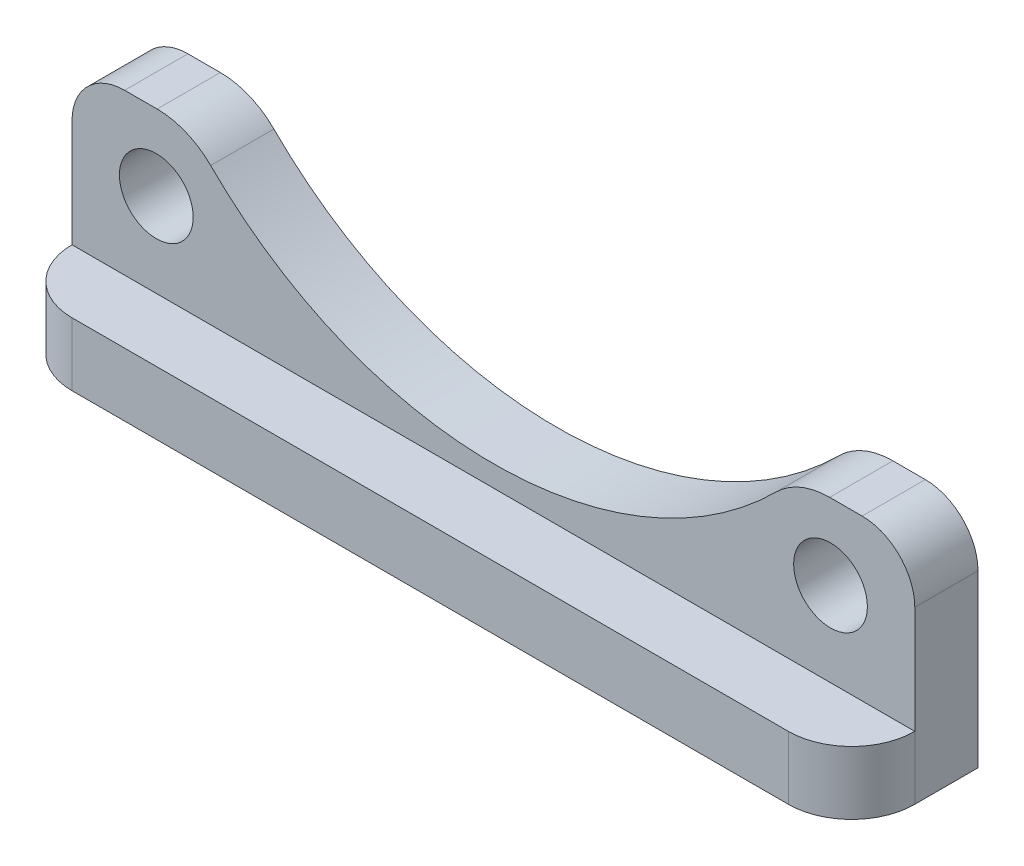
ISO-10303-21;
HEADER;
FILE_DESCRIPTION(('STEP AP214'),'2;1');
FILE_NAME('part.step','',(''),(''),'','','');
FILE_SCHEMA(('AUTOMOTIVE_DESIGN { 1 0 10303 214 1 1 1 1 }'));
ENDSEC;
DATA;
#1=APPLICATION_CONTEXT('core data for automotive mechanical design processes');
#2=APPLICATION_PROTOCOL_DEFINITION('international standard','automotive_design',2000,#1);
#3=PRODUCT_CONTEXT('',#1,'mechanical');
#4=PRODUCT('Part','Part','',(#3));
#5=PRODUCT_RELATED_PRODUCT_CATEGORY('part','',(#4));
#6=PRODUCT_DEFINITION_FORMATION('','',#4);
#7=PRODUCT_DEFINITION_CONTEXT('part definition',#1,'design');
#8=PRODUCT_DEFINITION('design','',#6,#7);
#9=PRODUCT_DEFINITION_SHAPE('','',#8);
#10=(LENGTH_UNIT() NAMED_UNIT(*) SI_UNIT(.MILLI.,.METRE.));
#11=(NAMED_UNIT(*) PLANE_ANGLE_UNIT() SI_UNIT($,.RADIAN.));
#12=(NAMED_UNIT(*) SI_UNIT($,.STERADIAN.) SOLID_ANGLE_UNIT());
#13=UNCERTAINTY_MEASURE_WITH_UNIT(LENGTH_MEASURE(1.E-05),#10,'distance_accuracy_value','');
#14=(GEOMETRIC_REPRESENTATION_CONTEXT(3) GLOBAL_UNCERTAINTY_ASSIGNED_CONTEXT((#13)) GLOBAL_UNIT_ASSIGNED_CONTEXT((#10,
#11,#12)) REPRESENTATION_CONTEXT('',''));
#15=CARTESIAN_POINT('',(0.,0.,0.));
#16=DIRECTION('',(0.,0.,1.));
#17=DIRECTION('',(1.,0.,0.));
#18=AXIS2_PLACEMENT_3D('',#15,#16,#17);
#19=CARTESIAN_POINT('',(-20.,5.30000000000001,3.));
#20=DIRECTION('',(0.,-1.,0.));
#21=DIRECTION('',(0.,0.,-1.));
#22=AXIS2_PLACEMENT_3D('',#19,#20,#21);
#23=PLANE('',#22);
#24=DIRECTION('',(-1.,0.,0.));
#25=VECTOR('',#24,1.);
#26=CARTESIAN_POINT('',(-20.,5.30000000000001,3.));
#27=LINE('',#26,#25);
#28=CARTESIAN_POINT('',(-15.961202962183,5.30000000000001,3.));
#29=VERTEX_POINT('',#28);
#30=CARTESIAN_POINT('',(-17.5,5.30000000000001,3.));
#31=VERTEX_POINT('',#30);
#32=EDGE_CURVE('E274',#29,#31,#27,.T.);
#33=ORIENTED_EDGE('',*,*,#32,.F.);
#34=DIRECTION('',(0.,0.,-1.));
#35=VECTOR('',#34,1.);
#36=CARTESIAN_POINT('',(-15.961202962183,5.30000000000001,3.));
#37=LINE('',#36,#35);
#38=CARTESIAN_POINT('',(-15.961202962183,5.30000000000001,0.));
#39=VERTEX_POINT('',#38);
#40=EDGE_CURVE('E12',#29,#39,#37,.T.);
#41=ORIENTED_EDGE('',*,*,#40,.T.);
#42=DIRECTION('',(-1.,0.,0.));
#43=VECTOR('',#42,1.);
#44=CARTESIAN_POINT('',(-20.,5.30000000000001,0.));
#45=LINE('',#44,#43);
#46=CARTESIAN_POINT('',(-17.5,5.30000000000001,0.));
#47=VERTEX_POINT('',#46);
#48=EDGE_CURVE('E242',#39,#47,#45,.T.);
#49=ORIENTED_EDGE('',*,*,#48,.T.);
#50=DIRECTION('',(0.,0.,-1.));
#51=VECTOR('',#50,1.);
#52=CARTESIAN_POINT('',(-17.5,5.30000000000001,3.));
#53=LINE('',#52,#51);
#54=EDGE_CURVE('E202',#47,#31,#53,.F.);
#55=ORIENTED_EDGE('',*,*,#54,.T.);
#56=EDGE_LOOP('',(#33,#41,#49,#55));
#57=FACE_BOUND('',#56,.T.);
#58=ADVANCED_FACE('F55',(#57),#23,.F.);
#59=CARTESIAN_POINT('',(20.,5.30000000000001,3.));
#60=DIRECTION('',(-1.,0.,0.));
#61=DIRECTION('',(0.,-1.,0.));
#62=AXIS2_PLACEMENT_3D('',#59,#60,#61);
#63=PLANE('',#62);
#64=DIRECTION('',(0.,1.,0.));
#65=VECTOR('',#64,1.);
#66=CARTESIAN_POINT('',(20.,5.30000000000001,0.));
#67=LINE('',#66,#65);
#68=CARTESIAN_POINT('',(20.,-5.3,0.));
#69=VERTEX_POINT('',#68);
#70=CARTESIAN_POINT('',(20.,2.80000000000001,0.));
#71=VERTEX_POINT('',#70);
#72=EDGE_CURVE('E246',#69,#71,#67,.T.);
#73=ORIENTED_EDGE('',*,*,#72,.T.);
#74=DIRECTION('',(0.,0.,-1.));
#75=VECTOR('',#74,1.);
#76=CARTESIAN_POINT('',(20.,2.80000000000001,3.));
#77=LINE('',#76,#75);
#78=CARTESIAN_POINT('',(20.,2.80000000000001,3.));
#79=VERTEX_POINT('',#78);
#80=EDGE_CURVE('E211',#71,#79,#77,.F.);
#81=ORIENTED_EDGE('',*,*,#80,.T.);
#82=DIRECTION('',(0.,1.,0.));
#83=VECTOR('',#82,1.);
#84=CARTESIAN_POINT('',(20.,5.30000000000001,3.));
#85=LINE('',#84,#83);
#86=CARTESIAN_POINT('',(20.,-2.3,3.));
#87=VERTEX_POINT('',#86);
#88=EDGE_CURVE('E251',#87,#79,#85,.T.);
#89=ORIENTED_EDGE('',*,*,#88,.F.);
#90=DIRECTION('',(0.,1.,0.));
#91=VECTOR('',#90,1.);
#92=CARTESIAN_POINT('',(20.,5.30000000000001,3.));
#93=LINE('',#92,#91);
#94=CARTESIAN_POINT('',(20.,-5.3,3.));
#95=VERTEX_POINT('',#94);
#96=EDGE_CURVE('E190',#87,#95,#93,.F.);
#97=ORIENTED_EDGE('',*,*,#96,.T.);
#98=DIRECTION('',(0.,0.,-1.));
#99=VECTOR('',#98,1.);
#100=CARTESIAN_POINT('',(20.,-5.3,3.));
#101=LINE('',#100,#99);
#102=EDGE_CURVE('E164',#95,#69,#101,.T.);
#103=ORIENTED_EDGE('',*,*,#102,.T.);
#104=EDGE_LOOP('',(#73,#81,#89,#97,#103));
#105=FACE_BOUND('',#104,.T.);
#106=ADVANCED_FACE('F289',(#105),#63,.F.);
#107=CARTESIAN_POINT('',(17.5,5.30000000000001,0.));
#108=VERTEX_POINT('',#107);
#109=CARTESIAN_POINT('',(15.961202962183,5.30000000000001,0.));
#110=VERTEX_POINT('',#109);
#111=EDGE_CURVE('E238',#108,#110,#45,.T.);
#112=ORIENTED_EDGE('',*,*,#111,.T.);
#113=DIRECTION('',(0.,0.,-1.));
#114=VECTOR('',#113,1.);
#115=CARTESIAN_POINT('',(15.961202962183,5.30000000000001,3.));
#116=LINE('',#115,#114);
#117=CARTESIAN_POINT('',(15.961202962183,5.30000000000001,3.));
#118=VERTEX_POINT('',#117);
#119=EDGE_CURVE('E78',#110,#118,#116,.F.);
#120=ORIENTED_EDGE('',*,*,#119,.T.);
#121=CARTESIAN_POINT('',(17.5,5.30000000000001,3.));
#122=VERTEX_POINT('',#121);
#123=EDGE_CURVE('E165',#122,#118,#27,.T.);
#124=ORIENTED_EDGE('',*,*,#123,.F.);
#125=DIRECTION('',(0.,0.,-1.));
#126=VECTOR('',#125,1.);
#127=CARTESIAN_POINT('',(17.5,5.30000000000001,3.));
#128=LINE('',#127,#126);
#129=EDGE_CURVE('E208',#122,#108,#128,.T.);
#130=ORIENTED_EDGE('',*,*,#129,.T.);
#131=EDGE_LOOP('',(#112,#120,#124,#130));
#132=FACE_BOUND('',#131,.T.);
#133=ADVANCED_FACE('F239',(#132),#23,.F.);
#134=CARTESIAN_POINT('',(-20.,5.30000000000001,3.));
#135=DIRECTION('',(1.,0.,0.));
#136=DIRECTION('',(0.,0.,-1.));
#137=AXIS2_PLACEMENT_3D('',#134,#135,#136);
#138=PLANE('',#137);
#139=DIRECTION('',(0.,-1.,0.));
#140=VECTOR('',#139,1.);
#141=CARTESIAN_POINT('',(-20.,5.30000000000001,3.));
#142=LINE('',#141,#140);
#143=CARTESIAN_POINT('',(-20.,2.80000000000001,3.));
#144=VERTEX_POINT('',#143);
#145=CARTESIAN_POINT('',(-20.,-2.3,3.));
#146=VERTEX_POINT('',#145);
#147=EDGE_CURVE('E152',#144,#146,#142,.T.);
#148=ORIENTED_EDGE('',*,*,#147,.F.);
#149=DIRECTION('',(0.,0.,-1.));
#150=VECTOR('',#149,1.);
#151=CARTESIAN_POINT('',(-20.,2.80000000000001,3.));
#152=LINE('',#151,#150);
#153=CARTESIAN_POINT('',(-20.,2.80000000000001,0.));
#154=VERTEX_POINT('',#153);
#155=EDGE_CURVE('E192',#144,#154,#152,.T.);
#156=ORIENTED_EDGE('',*,*,#155,.T.);
#157=DIRECTION('',(0.,-1.,0.));
#158=VECTOR('',#157,1.);
#159=CARTESIAN_POINT('',(-20.,5.30000000000001,0.));
#160=LINE('',#159,#158);
#161=CARTESIAN_POINT('',(-20.,-5.3,0.));
#162=VERTEX_POINT('',#161);
#163=EDGE_CURVE('E241',#154,#162,#160,.T.);
#164=ORIENTED_EDGE('',*,*,#163,.T.);
#165=DIRECTION('',(0.,0.,-1.));
#166=VECTOR('',#165,1.);
#167=CARTESIAN_POINT('',(-20.,-5.3,3.));
#168=LINE('',#167,#166);
#169=CARTESIAN_POINT('',(-20.,-5.3,3.));
#170=VERTEX_POINT('',#169);
#171=EDGE_CURVE('E172',#170,#162,#168,.T.);
#172=ORIENTED_EDGE('',*,*,#171,.F.);
#173=DIRECTION('',(0.,-1.,0.));
#174=VECTOR('',#173,1.);
#175=CARTESIAN_POINT('',(-20.,5.30000000000001,3.));
#176=LINE('',#175,#174);
#177=EDGE_CURVE('E169',#170,#146,#176,.F.);
#178=ORIENTED_EDGE('',*,*,#177,.T.);
#179=EDGE_LOOP('',(#148,#156,#164,#172,#178));
#180=FACE_BOUND('',#179,.T.);
#181=ADVANCED_FACE('F170',(#180),#138,.F.);
#182=CARTESIAN_POINT('',(-20.,-5.3,3.));
#183=DIRECTION('',(0.,1.,0.));
#184=DIRECTION('',(0.,0.,1.));
#185=AXIS2_PLACEMENT_3D('',#182,#183,#184);
#186=PLANE('',#185);
#187=DIRECTION('',(1.,0.,0.));
#188=VECTOR('',#187,1.);
#189=CARTESIAN_POINT('',(-20.,-5.3,6.));
#190=LINE('',#189,#188);
#191=CARTESIAN_POINT('',(-17.,-5.3,6.));
#192=VERTEX_POINT('',#191);
#193=CARTESIAN_POINT('',(17.,-5.3,6.));
#194=VERTEX_POINT('',#193);
#195=EDGE_CURVE('E183',#192,#194,#190,.T.);
#196=ORIENTED_EDGE('',*,*,#195,.F.);
#197=CARTESIAN_POINT('',(-17.,-5.3,3.));
#198=DIRECTION('',(0.,1.,0.));
#199=DIRECTION('',(0.,0.,1.));
#200=AXIS2_PLACEMENT_3D('',#197,#198,#199);
#201=CIRCLE('',#200,3.);
#202=EDGE_CURVE('E176',#192,#170,#201,.F.);
#203=ORIENTED_EDGE('',*,*,#202,.T.);
#204=ORIENTED_EDGE('',*,*,#171,.T.);
#205=DIRECTION('',(1.,0.,0.));
#206=VECTOR('',#205,1.);
#207=CARTESIAN_POINT('',(-20.,-5.3,0.));
#208=LINE('',#207,#206);
#209=EDGE_CURVE('E244',#162,#69,#208,.T.);
#210=ORIENTED_EDGE('',*,*,#209,.T.);
#211=ORIENTED_EDGE('',*,*,#102,.F.);
#212=CARTESIAN_POINT('',(17.,-5.3,3.));
#213=DIRECTION('',(0.,1.,0.));
#214=DIRECTION('',(0.,0.,1.));
#215=AXIS2_PLACEMENT_3D('',#212,#213,#214);
#216=CIRCLE('',#215,3.);
#217=EDGE_CURVE('E258',#95,#194,#216,.F.);
#218=ORIENTED_EDGE('',*,*,#217,.T.);
#219=EDGE_LOOP('',(#196,#203,#204,#210,#211,#218));
#220=FACE_BOUND('',#219,.T.);
#221=ADVANCED_FACE('F262',(#220),#186,.F.);
#222=CARTESIAN_POINT('',(0.,0.,3.));
#223=DIRECTION('',(0.,0.,1.));
#224=DIRECTION('',(1.,0.,0.));
#225=AXIS2_PLACEMENT_3D('',#222,#223,#224);
#226=PLANE('',#225);
#227=CARTESIAN_POINT('',(16.,1.7,3.));
#228=DIRECTION('',(0.,0.,1.));
#229=DIRECTION('',(1.,0.,0.));
#230=AXIS2_PLACEMENT_3D('',#227,#228,#229);
#231=CIRCLE('',#230,1.75);
#232=CARTESIAN_POINT('',(17.75,1.7,3.));
#233=VERTEX_POINT('',#232);
#234=EDGE_CURVE('E348',#233,#233,#231,.F.);
#235=ORIENTED_EDGE('',*,*,#234,.T.);
#236=EDGE_LOOP('',(#235));
#237=FACE_BOUND('',#236,.T.);
#238=CARTESIAN_POINT('',(-16.,1.70000000000002,3.));
#239=DIRECTION('',(0.,0.,1.));
#240=DIRECTION('',(1.,0.,0.));
#241=AXIS2_PLACEMENT_3D('',#238,#239,#240);
#242=CIRCLE('',#241,1.75);
#243=CARTESIAN_POINT('',(-14.25,1.70000000000002,3.));
#244=VERTEX_POINT('',#243);
#245=EDGE_CURVE('E344',#244,#244,#242,.F.);
#246=ORIENTED_EDGE('',*,*,#245,.T.);
#247=EDGE_LOOP('',(#246));
#248=FACE_BOUND('',#247,.T.);
#249=ORIENTED_EDGE('',*,*,#123,.T.);
#250=CARTESIAN_POINT('',(15.961202962183,1.70000000000001,3.));
#251=DIRECTION('',(0.,0.,1.));
#252=DIRECTION('',(1.,0.,0.));
#253=AXIS2_PLACEMENT_3D('',#250,#251,#252);
#254=CIRCLE('',#253,3.6);
#255=CARTESIAN_POINT('',(13.4187104549326,4.24867256637169,3.));
#256=VERTEX_POINT('',#255);
#257=EDGE_CURVE('E63',#118,#256,#254,.T.);
#258=ORIENTED_EDGE('',*,*,#257,.T.);
#259=CARTESIAN_POINT('',(0.,17.7,3.));
#260=DIRECTION('',(0.,0.,1.));
#261=DIRECTION('',(1.,0.,0.));
#262=AXIS2_PLACEMENT_3D('',#259,#260,#261);
#263=CIRCLE('',#262,19.);
#264=CARTESIAN_POINT('',(-13.4187104549326,4.24867256637169,3.));
#265=VERTEX_POINT('',#264);
#266=EDGE_CURVE('E184',#256,#265,#263,.F.);
#267=ORIENTED_EDGE('',*,*,#266,.T.);
#268=CARTESIAN_POINT('',(-15.961202962183,1.70000000000001,3.));
#269=DIRECTION('',(0.,0.,1.));
#270=DIRECTION('',(1.,0.,0.));
#271=AXIS2_PLACEMENT_3D('',#268,#269,#270);
#272=CIRCLE('',#271,3.6);
#273=EDGE_CURVE('E70',#265,#29,#272,.T.);
#274=ORIENTED_EDGE('',*,*,#273,.T.);
#275=ORIENTED_EDGE('',*,*,#32,.T.);
#276=CARTESIAN_POINT('',(-17.5,2.80000000000001,3.));
#277=DIRECTION('',(0.,0.,1.));
#278=DIRECTION('',(1.,0.,0.));
#279=AXIS2_PLACEMENT_3D('',#276,#277,#278);
#280=CIRCLE('',#279,2.5);
#281=EDGE_CURVE('E160',#31,#144,#280,.T.);
#282=ORIENTED_EDGE('',*,*,#281,.T.);
#283=ORIENTED_EDGE('',*,*,#147,.T.);
#284=DIRECTION('',(-1.,0.,0.));
#285=VECTOR('',#284,1.);
#286=CARTESIAN_POINT('',(-20.,-2.3,3.));
#287=LINE('',#286,#285);
#288=EDGE_CURVE('E157',#87,#146,#287,.T.);
#289=ORIENTED_EDGE('',*,*,#288,.F.);
#290=ORIENTED_EDGE('',*,*,#88,.T.);
#291=CARTESIAN_POINT('',(17.5,2.80000000000001,3.));
#292=DIRECTION('',(0.,0.,1.));
#293=DIRECTION('',(1.,0.,0.));
#294=AXIS2_PLACEMENT_3D('',#291,#292,#293);
#295=CIRCLE('',#294,2.5);
#296=EDGE_CURVE('E205',#79,#122,#295,.T.);
#297=ORIENTED_EDGE('',*,*,#296,.T.);
#298=EDGE_LOOP('',(#249,#258,#267,#274,#275,#282,#283,#289,#290,#297));
#299=FACE_BOUND('',#298,.T.);
#300=ADVANCED_FACE('F154',(#237,#248,#299),#226,.T.);
#301=CARTESIAN_POINT('',(0.,0.,0.));
#302=DIRECTION('',(0.,0.,1.));
#303=DIRECTION('',(1.,0.,0.));
#304=AXIS2_PLACEMENT_3D('',#301,#302,#303);
#305=PLANE('',#304);
#306=CARTESIAN_POINT('',(16.,1.7,0.));
#307=DIRECTION('',(0.,0.,-1.));
#308=DIRECTION('',(-1.,0.,0.));
#309=AXIS2_PLACEMENT_3D('',#306,#307,#308);
#310=CIRCLE('',#309,1.75);
#311=CARTESIAN_POINT('',(14.25,1.7,0.));
#312=VERTEX_POINT('',#311);
#313=EDGE_CURVE('E351',#312,#312,#310,.T.);
#314=ORIENTED_EDGE('',*,*,#313,.F.);
#315=EDGE_LOOP('',(#314));
#316=FACE_BOUND('',#315,.T.);
#317=CARTESIAN_POINT('',(-16.,1.70000000000002,0.));
#318=DIRECTION('',(0.,0.,-1.));
#319=DIRECTION('',(-1.,0.,0.));
#320=AXIS2_PLACEMENT_3D('',#317,#318,#319);
#321=CIRCLE('',#320,1.75);
#322=CARTESIAN_POINT('',(-17.75,1.70000000000002,0.));
#323=VERTEX_POINT('',#322);
#324=EDGE_CURVE('E341',#323,#323,#321,.T.);
#325=ORIENTED_EDGE('',*,*,#324,.F.);
#326=EDGE_LOOP('',(#325));
#327=FACE_BOUND('',#326,.T.);
#328=CARTESIAN_POINT('',(0.,17.7,0.));
#329=DIRECTION('',(0.,0.,-1.));
#330=DIRECTION('',(-1.,0.,0.));
#331=AXIS2_PLACEMENT_3D('',#328,#329,#330);
#332=CIRCLE('',#331,19.);
#333=CARTESIAN_POINT('',(13.4187104549326,4.24867256637169,0.));
#334=VERTEX_POINT('',#333);
#335=CARTESIAN_POINT('',(-13.4187104549326,4.24867256637169,0.));
#336=VERTEX_POINT('',#335);
#337=EDGE_CURVE('E232',#334,#336,#332,.T.);
#338=ORIENTED_EDGE('',*,*,#337,.F.);
#339=CARTESIAN_POINT('',(15.961202962183,1.70000000000001,0.));
#340=DIRECTION('',(0.,0.,1.));
#341=DIRECTION('',(1.,0.,0.));
#342=AXIS2_PLACEMENT_3D('',#339,#340,#341);
#343=CIRCLE('',#342,3.6);
#344=EDGE_CURVE('E220',#334,#110,#343,.F.);
#345=ORIENTED_EDGE('',*,*,#344,.T.);
#346=ORIENTED_EDGE('',*,*,#111,.F.);
#347=CARTESIAN_POINT('',(17.5,2.80000000000001,0.));
#348=DIRECTION('',(0.,0.,1.));
#349=DIRECTION('',(1.,0.,0.));
#350=AXIS2_PLACEMENT_3D('',#347,#348,#349);
#351=CIRCLE('',#350,2.5);
#352=EDGE_CURVE('E197',#108,#71,#351,.F.);
#353=ORIENTED_EDGE('',*,*,#352,.T.);
#354=ORIENTED_EDGE('',*,*,#72,.F.);
#355=ORIENTED_EDGE('',*,*,#209,.F.);
#356=ORIENTED_EDGE('',*,*,#163,.F.);
#357=CARTESIAN_POINT('',(-17.5,2.80000000000001,0.));
#358=DIRECTION('',(0.,0.,1.));
#359=DIRECTION('',(1.,0.,0.));
#360=AXIS2_PLACEMENT_3D('',#357,#358,#359);
#361=CIRCLE('',#360,2.5);
#362=EDGE_CURVE('E199',#154,#47,#361,.F.);
#363=ORIENTED_EDGE('',*,*,#362,.T.);
#364=ORIENTED_EDGE('',*,*,#48,.F.);
#365=CARTESIAN_POINT('',(-15.961202962183,1.70000000000001,0.));
#366=DIRECTION('',(0.,0.,1.));
#367=DIRECTION('',(1.,0.,0.));
#368=AXIS2_PLACEMENT_3D('',#365,#366,#367);
#369=CIRCLE('',#368,3.6);
#370=EDGE_CURVE('E218',#39,#336,#369,.F.);
#371=ORIENTED_EDGE('',*,*,#370,.T.);
#372=EDGE_LOOP('',(#338,#345,#346,#353,#354,#355,#356,#363,#364,#371));
#373=FACE_BOUND('',#372,.T.);
#374=ADVANCED_FACE('F237',(#316,#327,#373),#305,.F.);
#375=CARTESIAN_POINT('',(-20.,-2.3,6.));
#376=DIRECTION('',(0.,-1.,0.));
#377=DIRECTION('',(0.,0.,-1.));
#378=AXIS2_PLACEMENT_3D('',#375,#376,#377);
#379=PLANE('',#378);
#380=ORIENTED_EDGE('',*,*,#288,.T.);
#381=CARTESIAN_POINT('',(-17.,-2.3,3.));
#382=DIRECTION('',(0.,-1.,0.));
#383=DIRECTION('',(0.,0.,-1.));
#384=AXIS2_PLACEMENT_3D('',#381,#382,#383);
#385=CIRCLE('',#384,3.);
#386=CARTESIAN_POINT('',(-17.,-2.3,6.));
#387=VERTEX_POINT('',#386);
#388=EDGE_CURVE('E181',#146,#387,#385,.F.);
#389=ORIENTED_EDGE('',*,*,#388,.T.);
#390=DIRECTION('',(-1.,0.,0.));
#391=VECTOR('',#390,1.);
#392=CARTESIAN_POINT('',(-20.,-2.3,6.));
#393=LINE('',#392,#391);
#394=CARTESIAN_POINT('',(17.,-2.3,6.));
#395=VERTEX_POINT('',#394);
#396=EDGE_CURVE('E268',#395,#387,#393,.T.);
#397=ORIENTED_EDGE('',*,*,#396,.F.);
#398=CARTESIAN_POINT('',(17.,-2.3,3.));
#399=DIRECTION('',(0.,-1.,0.));
#400=DIRECTION('',(0.,0.,-1.));
#401=AXIS2_PLACEMENT_3D('',#398,#399,#400);
#402=CIRCLE('',#401,3.);
#403=EDGE_CURVE('E175',#395,#87,#402,.F.);
#404=ORIENTED_EDGE('',*,*,#403,.T.);
#405=EDGE_LOOP('',(#380,#389,#397,#404));
#406=FACE_BOUND('',#405,.T.);
#407=ADVANCED_FACE('F179',(#406),#379,.F.);
#408=CARTESIAN_POINT('',(0.,0.,6.));
#409=DIRECTION('',(0.,0.,-1.));
#410=DIRECTION('',(-1.,0.,0.));
#411=AXIS2_PLACEMENT_3D('',#408,#409,#410);
#412=PLANE('',#411);
#413=ORIENTED_EDGE('',*,*,#396,.T.);
#414=DIRECTION('',(0.,-1.,0.));
#415=VECTOR('',#414,1.);
#416=CARTESIAN_POINT('',(-17.,0.,6.));
#417=LINE('',#416,#415);
#418=EDGE_CURVE('E189',#387,#192,#417,.T.);
#419=ORIENTED_EDGE('',*,*,#418,.T.);
#420=ORIENTED_EDGE('',*,*,#195,.T.);
#421=DIRECTION('',(0.,1.,0.));
#422=VECTOR('',#421,1.);
#423=CARTESIAN_POINT('',(17.,0.,6.));
#424=LINE('',#423,#422);
#425=EDGE_CURVE('E254',#194,#395,#424,.T.);
#426=ORIENTED_EDGE('',*,*,#425,.T.);
#427=EDGE_LOOP('',(#413,#419,#420,#426));
#428=FACE_BOUND('',#427,.T.);
#429=ADVANCED_FACE('F266',(#428),#412,.F.);
#430=CARTESIAN_POINT('',(-17.,0.,3.));
#431=DIRECTION('',(0.,-1.,0.));
#432=DIRECTION('',(0.,0.,-1.));
#433=AXIS2_PLACEMENT_3D('',#430,#431,#432);
#434=CYLINDRICAL_SURFACE('',#433,3.);
#435=ORIENTED_EDGE('',*,*,#388,.F.);
#436=ORIENTED_EDGE('',*,*,#177,.F.);
#437=ORIENTED_EDGE('',*,*,#202,.F.);
#438=ORIENTED_EDGE('',*,*,#418,.F.);
#439=EDGE_LOOP('',(#435,#436,#437,#438));
#440=FACE_BOUND('',#439,.T.);
#441=ADVANCED_FACE('F187',(#440),#434,.T.);
#442=CARTESIAN_POINT('',(17.,0.,3.));
#443=DIRECTION('',(0.,1.,0.));
#444=DIRECTION('',(-1.,0.,0.));
#445=AXIS2_PLACEMENT_3D('',#442,#443,#444);
#446=CYLINDRICAL_SURFACE('',#445,3.);
#447=ORIENTED_EDGE('',*,*,#217,.F.);
#448=ORIENTED_EDGE('',*,*,#96,.F.);
#449=ORIENTED_EDGE('',*,*,#403,.F.);
#450=ORIENTED_EDGE('',*,*,#425,.F.);
#451=EDGE_LOOP('',(#447,#448,#449,#450));
#452=FACE_BOUND('',#451,.T.);
#453=ADVANCED_FACE('F288',(#452),#446,.T.);
#454=CARTESIAN_POINT('',(0.,17.7,32.5384495192283));
#455=DIRECTION('',(0.,0.,-1.));
#456=DIRECTION('',(-1.,0.,0.));
#457=AXIS2_PLACEMENT_3D('',#454,#455,#456);
#458=CYLINDRICAL_SURFACE('',#457,19.);
#459=ORIENTED_EDGE('',*,*,#266,.F.);
#460=DIRECTION('',(0.,0.,-1.));
#461=VECTOR('',#460,1.);
#462=CARTESIAN_POINT('',(13.4187104549326,4.24867256637169,32.5384495192283));
#463=LINE('',#462,#461);
#464=EDGE_CURVE('E215',#256,#334,#463,.T.);
#465=ORIENTED_EDGE('',*,*,#464,.T.);
#466=ORIENTED_EDGE('',*,*,#337,.T.);
#467=DIRECTION('',(0.,0.,-1.));
#468=VECTOR('',#467,1.);
#469=CARTESIAN_POINT('',(-13.4187104549326,4.24867256637169,32.5384495192283));
#470=LINE('',#469,#468);
#471=EDGE_CURVE('E213',#336,#265,#470,.F.);
#472=ORIENTED_EDGE('',*,*,#471,.T.);
#473=EDGE_LOOP('',(#459,#465,#466,#472));
#474=FACE_BOUND('',#473,.T.);
#475=ADVANCED_FACE('F228',(#474),#458,.F.);
#476=CARTESIAN_POINT('',(-16.,1.70000000000002,32.5384495192283));
#477=DIRECTION('',(0.,0.,-1.));
#478=DIRECTION('',(-1.,0.,0.));
#479=AXIS2_PLACEMENT_3D('',#476,#477,#478);
#480=CYLINDRICAL_SURFACE('',#479,1.75);
#481=ORIENTED_EDGE('',*,*,#324,.T.);
#482=EDGE_LOOP('',(#481));
#483=FACE_BOUND('',#482,.T.);
#484=ORIENTED_EDGE('',*,*,#245,.F.);
#485=EDGE_LOOP('',(#484));
#486=FACE_BOUND('',#485,.T.);
#487=ADVANCED_FACE('F330',(#483,#486),#480,.F.);
#488=CARTESIAN_POINT('',(16.,1.7,32.5384495192283));
#489=DIRECTION('',(0.,0.,-1.));
#490=DIRECTION('',(-1.,0.,0.));
#491=AXIS2_PLACEMENT_3D('',#488,#489,#490);
#492=CYLINDRICAL_SURFACE('',#491,1.75);
#493=ORIENTED_EDGE('',*,*,#313,.T.);
#494=EDGE_LOOP('',(#493));
#495=FACE_BOUND('',#494,.T.);
#496=ORIENTED_EDGE('',*,*,#234,.F.);
#497=EDGE_LOOP('',(#496));
#498=FACE_BOUND('',#497,.T.);
#499=ADVANCED_FACE('F300',(#495,#498),#492,.F.);
#500=CARTESIAN_POINT('',(-17.5,2.80000000000001,3.));
#501=DIRECTION('',(0.,0.,-1.));
#502=DIRECTION('',(-1.,0.,0.));
#503=AXIS2_PLACEMENT_3D('',#500,#501,#502);
#504=CYLINDRICAL_SURFACE('',#503,2.5);
#505=ORIENTED_EDGE('',*,*,#281,.F.);
#506=ORIENTED_EDGE('',*,*,#54,.F.);
#507=ORIENTED_EDGE('',*,*,#362,.F.);
#508=ORIENTED_EDGE('',*,*,#155,.F.);
#509=EDGE_LOOP('',(#505,#506,#507,#508));
#510=FACE_BOUND('',#509,.T.);
#511=ADVANCED_FACE('F280',(#510),#504,.T.);
#512=CARTESIAN_POINT('',(17.5,2.80000000000001,3.));
#513=DIRECTION('',(0.,0.,-1.));
#514=DIRECTION('',(-1.,0.,0.));
#515=AXIS2_PLACEMENT_3D('',#512,#513,#514);
#516=CYLINDRICAL_SURFACE('',#515,2.5);
#517=ORIENTED_EDGE('',*,*,#296,.F.);
#518=ORIENTED_EDGE('',*,*,#80,.F.);
#519=ORIENTED_EDGE('',*,*,#352,.F.);
#520=ORIENTED_EDGE('',*,*,#129,.F.);
#521=EDGE_LOOP('',(#517,#518,#519,#520));
#522=FACE_BOUND('',#521,.T.);
#523=ADVANCED_FACE('F293',(#522),#516,.T.);
#524=CARTESIAN_POINT('',(15.961202962183,1.70000000000001,32.5384495192283));
#525=DIRECTION('',(0.,0.,-1.));
#526=DIRECTION('',(-1.,0.,0.));
#527=AXIS2_PLACEMENT_3D('',#524,#525,#526);
#528=CYLINDRICAL_SURFACE('',#527,3.6);
#529=ORIENTED_EDGE('',*,*,#257,.F.);
#530=ORIENTED_EDGE('',*,*,#119,.F.);
#531=ORIENTED_EDGE('',*,*,#344,.F.);
#532=ORIENTED_EDGE('',*,*,#464,.F.);
#533=EDGE_LOOP('',(#529,#530,#531,#532));
#534=FACE_BOUND('',#533,.T.);
#535=ADVANCED_FACE('F234',(#534),#528,.T.);
#536=CARTESIAN_POINT('',(-15.961202962183,1.70000000000001,32.5384495192283));
#537=DIRECTION('',(0.,0.,-1.));
#538=DIRECTION('',(-1.,0.,0.));
#539=AXIS2_PLACEMENT_3D('',#536,#537,#538);
#540=CYLINDRICAL_SURFACE('',#539,3.6);
#541=ORIENTED_EDGE('',*,*,#273,.F.);
#542=ORIENTED_EDGE('',*,*,#471,.F.);
#543=ORIENTED_EDGE('',*,*,#370,.F.);
#544=ORIENTED_EDGE('',*,*,#40,.F.);
#545=EDGE_LOOP('',(#541,#542,#543,#544));
#546=FACE_BOUND('',#545,.T.);
#547=ADVANCED_FACE('F57',(#546),#540,.T.);
#548=CLOSED_SHELL('',(#58,#106,#133,#181,#221,#300,#374,#407,#429,#441,#453,#475,#487,#499,#511,
#523,#535,#547));
#549=MANIFOLD_SOLID_BREP('B2',#548);
#550=ADVANCED_BREP_SHAPE_REPRESENTATION('',(#18,#549),#14);
#551=SHAPE_DEFINITION_REPRESENTATION(#9,#550);
ENDSEC;
END-ISO-10303-21;
